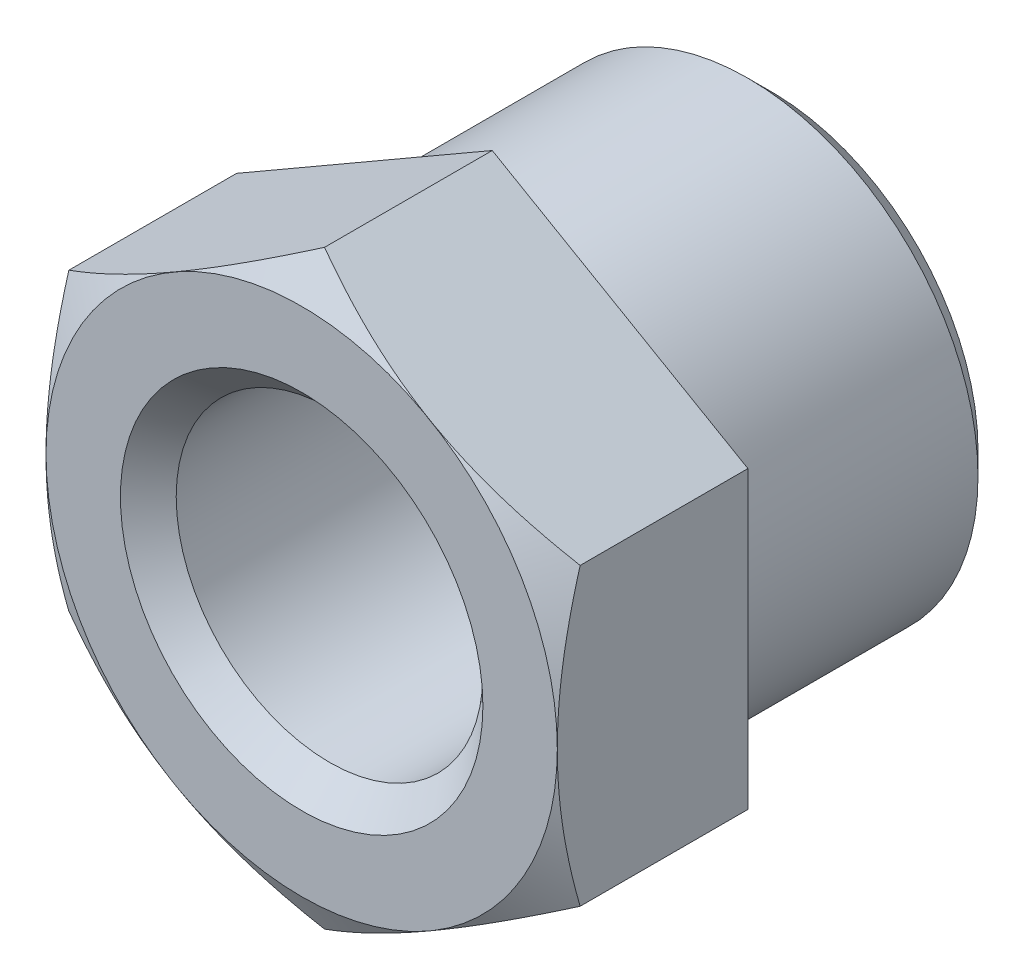
ISO-10303-21;
HEADER;
FILE_DESCRIPTION(('STEP AP214'),'2;1');
FILE_NAME('part.step','',(''),(''),'','','');
FILE_SCHEMA(('AUTOMOTIVE_DESIGN { 1 0 10303 214 1 1 1 1 }'));
ENDSEC;
DATA;
#1=APPLICATION_CONTEXT('core data for automotive mechanical design processes');
#2=APPLICATION_PROTOCOL_DEFINITION('international standard','automotive_design',2000,#1);
#3=PRODUCT_CONTEXT('',#1,'mechanical');
#4=PRODUCT('Part','Part','',(#3));
#5=PRODUCT_RELATED_PRODUCT_CATEGORY('part','',(#4));
#6=PRODUCT_DEFINITION_FORMATION('','',#4);
#7=PRODUCT_DEFINITION_CONTEXT('part definition',#1,'design');
#8=PRODUCT_DEFINITION('design','',#6,#7);
#9=PRODUCT_DEFINITION_SHAPE('','',#8);
#10=(LENGTH_UNIT() NAMED_UNIT(*) SI_UNIT(.MILLI.,.METRE.));
#11=(NAMED_UNIT(*) PLANE_ANGLE_UNIT() SI_UNIT($,.RADIAN.));
#12=(NAMED_UNIT(*) SI_UNIT($,.STERADIAN.) SOLID_ANGLE_UNIT());
#13=UNCERTAINTY_MEASURE_WITH_UNIT(LENGTH_MEASURE(1.E-05),#10,'distance_accuracy_value','');
#14=(GEOMETRIC_REPRESENTATION_CONTEXT(3) GLOBAL_UNCERTAINTY_ASSIGNED_CONTEXT((#13)) GLOBAL_UNIT_ASSIGNED_CONTEXT((#10,
#11,#12)) REPRESENTATION_CONTEXT('',''));
#15=CARTESIAN_POINT('',(0.,0.,0.));
#16=DIRECTION('',(0.,0.,1.));
#17=DIRECTION('',(1.,0.,0.));
#18=AXIS2_PLACEMENT_3D('',#15,#16,#17);
#19=CARTESIAN_POINT('',(0.,0.,-4.5085));
#20=DIRECTION('',(0.,0.,-1.));
#21=DIRECTION('',(-1.,0.,0.));
#22=AXIS2_PLACEMENT_3D('',#19,#20,#21);
#23=CYLINDRICAL_SURFACE('',#22,6.2865);
#24=CARTESIAN_POINT('',(0.,0.,-12.192));
#25=DIRECTION('',(0.,0.,-1.));
#26=DIRECTION('',(0.,1.,0.));
#27=AXIS2_PLACEMENT_3D('',#24,#25,#26);
#28=CIRCLE('',#27,6.2865);
#29=CARTESIAN_POINT('',(0.,6.2865,-12.192));
#30=VERTEX_POINT('',#29);
#31=EDGE_CURVE('E246',#30,#30,#28,.T.);
#32=ORIENTED_EDGE('',*,*,#31,.F.);
#33=EDGE_LOOP('',(#32));
#34=FACE_BOUND('',#33,.T.);
#35=CARTESIAN_POINT('',(0.,0.,-5.207));
#36=DIRECTION('',(0.,0.,-1.));
#37=DIRECTION('',(-1.,0.,0.));
#38=AXIS2_PLACEMENT_3D('',#35,#36,#37);
#39=CIRCLE('',#38,6.2865);
#40=CARTESIAN_POINT('',(-6.2865,0.,-5.207));
#41=VERTEX_POINT('',#40);
#42=EDGE_CURVE('E20',#41,#41,#39,.F.);
#43=ORIENTED_EDGE('',*,*,#42,.F.);
#44=EDGE_LOOP('',(#43));
#45=FACE_BOUND('',#44,.T.);
#46=ADVANCED_FACE('F16',(#34,#45),#23,.T.);
#47=CARTESIAN_POINT('',(6.985,-8.16128699912692,-5.207));
#48=DIRECTION('',(0.,0.,-1.));
#49=DIRECTION('',(-1.,0.,0.));
#50=AXIS2_PLACEMENT_3D('',#47,#48,#49);
#51=PLANE('',#50);
#52=ORIENTED_EDGE('',*,*,#42,.T.);
#53=EDGE_LOOP('',(#52));
#54=FACE_BOUND('',#53,.T.);
#55=DIRECTION('',(0.866025403784435,-0.500000000000007,0.));
#56=VECTOR('',#55,1.);
#57=CARTESIAN_POINT('',(-3.4925,-6.0481041848552,-5.207));
#58=LINE('',#57,#56);
#59=CARTESIAN_POINT('',(-6.98499999999993,-4.03170836971077,-5.207));
#60=VERTEX_POINT('',#59);
#61=CARTESIAN_POINT('',(0.,-8.0645,-5.207));
#62=VERTEX_POINT('',#61);
#63=EDGE_CURVE('E279',#60,#62,#58,.T.);
#64=ORIENTED_EDGE('',*,*,#63,.F.);
#65=DIRECTION('',(0.,-1.,0.));
#66=VECTOR('',#65,1.);
#67=CARTESIAN_POINT('',(-6.985,0.00108326057883914,-5.207));
#68=LINE('',#67,#66);
#69=CARTESIAN_POINT('',(-6.985,4.03387489086858,-5.207));
#70=VERTEX_POINT('',#69);
#71=EDGE_CURVE('E87',#70,#60,#68,.T.);
#72=ORIENTED_EDGE('',*,*,#71,.F.);
#73=DIRECTION('',(-0.866025403784435,-0.500000000000007,0.));
#74=VECTOR('',#73,1.);
#75=CARTESIAN_POINT('',(-3.4925,6.05027070601338,-5.207));
#76=LINE('',#75,#74);
#77=CARTESIAN_POINT('',(0.,8.06666652115819,-5.207));
#78=VERTEX_POINT('',#77);
#79=EDGE_CURVE('E271',#78,#70,#76,.T.);
#80=ORIENTED_EDGE('',*,*,#79,.F.);
#81=DIRECTION('',(-0.866025403784435,0.500000000000007,0.));
#82=VECTOR('',#81,1.);
#83=CARTESIAN_POINT('',(3.4925,6.05027070601338,-5.207));
#84=LINE('',#83,#82);
#85=CARTESIAN_POINT('',(6.985,4.03387489086858,-5.207));
#86=VERTEX_POINT('',#85);
#87=EDGE_CURVE('E261',#86,#78,#84,.T.);
#88=ORIENTED_EDGE('',*,*,#87,.F.);
#89=DIRECTION('',(0.,1.,0.));
#90=VECTOR('',#89,1.);
#91=CARTESIAN_POINT('',(6.985,0.00108326057883914,-5.207));
#92=LINE('',#91,#90);
#93=CARTESIAN_POINT('',(6.985,-4.03170836971073,-5.207));
#94=VERTEX_POINT('',#93);
#95=EDGE_CURVE('E254',#94,#86,#92,.T.);
#96=ORIENTED_EDGE('',*,*,#95,.F.);
#97=DIRECTION('',(0.866025403784435,0.500000000000007,0.));
#98=VECTOR('',#97,1.);
#99=CARTESIAN_POINT('',(3.4925,-6.0481041848552,-5.207));
#100=LINE('',#99,#98);
#101=EDGE_CURVE('E249',#62,#94,#100,.T.);
#102=ORIENTED_EDGE('',*,*,#101,.F.);
#103=EDGE_LOOP('',(#64,#72,#80,#88,#96,#102));
#104=FACE_BOUND('',#103,.T.);
#105=ADVANCED_FACE('F234',(#54,#104),#51,.T.);
#106=CARTESIAN_POINT('',(0.,0.,-12.1285));
#107=DIRECTION('',(0.,0.,1.));
#108=DIRECTION('',(1.,0.,0.));
#109=AXIS2_PLACEMENT_3D('',#106,#107,#108);
#110=CONICAL_SURFACE('',#109,6.35,0.785398163397448);
#111=ORIENTED_EDGE('',*,*,#31,.T.);
#112=EDGE_LOOP('',(#111));
#113=FACE_BOUND('',#112,.T.);
#114=CARTESIAN_POINT('',(0.,0.,-12.827));
#115=DIRECTION('',(0.,0.,1.));
#116=DIRECTION('',(1.,0.,0.));
#117=AXIS2_PLACEMENT_3D('',#114,#115,#116);
#118=CIRCLE('',#117,5.6515);
#119=CARTESIAN_POINT('',(5.6515,0.,-12.827));
#120=VERTEX_POINT('',#119);
#121=EDGE_CURVE('E88',#120,#120,#118,.F.);
#122=ORIENTED_EDGE('',*,*,#121,.F.);
#123=EDGE_LOOP('',(#122));
#124=FACE_BOUND('',#123,.T.);
#125=ADVANCED_FACE('F230',(#113,#124),#110,.T.);
#126=CARTESIAN_POINT('',(0.,-8.0645,-5.207));
#127=DIRECTION('',(0.500000000000007,-0.866025403784435,0.));
#128=DIRECTION('',(0.866025403784435,0.500000000000007,0.));
#129=AXIS2_PLACEMENT_3D('',#126,#127,#128);
#130=PLANE('',#129);
#131=ORIENTED_EDGE('',*,*,#101,.T.);
#132=DIRECTION('',(0.,0.,-1.));
#133=VECTOR('',#132,1.);
#134=CARTESIAN_POINT('',(6.985,-4.0317083697109,-2.587879));
#135=LINE('',#134,#133);
#136=CARTESIAN_POINT('',(6.985,-4.03170836971076,-0.623562357485163));
#137=VERTEX_POINT('',#136);
#138=EDGE_CURVE('E258',#137,#94,#135,.T.);
#139=ORIENTED_EDGE('',*,*,#138,.F.);
#140=CARTESIAN_POINT('',(3.5911702776349,-5.99113687350167,0.));
#141=CARTESIAN_POINT('',(3.73524611892084,-5.90795464775151,-0.00154926655879243));
#142=CARTESIAN_POINT('',(3.87928610456096,-5.82479312326811,-0.00657798005663551));
#143=CARTESIAN_POINT('',(4.16704483844373,-5.65865554079923,-0.023373223963552));
#144=CARTESIAN_POINT('',(4.31076364268868,-5.57567945048079,-0.0351384697799564));
#145=CARTESIAN_POINT('',(4.59701768470571,-5.41041060226564,-0.065116513372869));
#146=CARTESIAN_POINT('',(4.73955531763537,-5.32811646152405,-0.0832990386963194));
#147=CARTESIAN_POINT('',(5.02394745132829,-5.16392258658102,-0.125755048388477));
#148=CARTESIAN_POINT('',(5.16580193317152,-5.08202286330308,-0.150028700474948));
#149=CARTESIAN_POINT('',(5.58979915751715,-4.83722795169147,-0.23128512134236));
#150=CARTESIAN_POINT('',(5.87072458759034,-4.6750355790165,-0.296741834112847));
#151=CARTESIAN_POINT('',(6.43015699693444,-4.35204712688828,-0.446759338703408));
#152=CARTESIAN_POINT('',(6.70864624647853,-4.19126128369758,-0.531409047798544));
#153=CARTESIAN_POINT('',(6.98499999999982,-4.0317083697105,-0.623562357484995));
#154=B_SPLINE_CURVE_WITH_KNOTS('',3,(#140,#141,#142,#143,#144,#145,#146,#147,#148,#149,#150,
#151,#152,#153),.UNSPECIFIED.,.F.,.F.,(4,2,2,2,2,2,4),(0.,0.499065682751525,0.998036230101141,
1.4946837531994,1.99134495287294,2.98345617123692,3.98026111891649),.UNSPECIFIED.);
#155=CARTESIAN_POINT('',(3.59117027763756,-5.99113687350013,0.));
#156=VERTEX_POINT('',#155);
#157=EDGE_CURVE('E212',#156,#137,#154,.T.);
#158=ORIENTED_EDGE('',*,*,#157,.F.);
#159=DIRECTION('',(-0.866025403784435,-0.500000000000007,0.));
#160=VECTOR('',#159,1.);
#161=CARTESIAN_POINT('',(3.4925,-6.0481041848552,0.));
#162=LINE('',#161,#160);
#163=CARTESIAN_POINT('',(3.39289159118063,-6.10561312650061,0.));
#164=VERTEX_POINT('',#163);
#165=EDGE_CURVE('E201',#156,#164,#162,.T.);
#166=ORIENTED_EDGE('',*,*,#165,.T.);
#167=CARTESIAN_POINT('',(0.,-8.06449999999999,-0.623249615590151));
#168=CARTESIAN_POINT('',(0.276279709124286,-7.90498983556546,-0.531139462571051));
#169=CARTESIAN_POINT('',(0.554693783296573,-7.74424739489591,-0.446530866645139));
#170=CARTESIAN_POINT('',(1.1139744028162,-7.4213465786637,-0.296587816752658));
#171=CARTESIAN_POINT('',(1.39482323636993,-7.25919842900986,-0.231164515753889));
#172=CARTESIAN_POINT('',(1.81870361478494,-7.01447097842776,-0.149950296684653));
#173=CARTESIAN_POINT('',(1.96051872681603,-6.93259398532145,-0.125689405773082));
#174=CARTESIAN_POINT('',(2.24483160560906,-6.76844586821621,-0.0832558093614813));
#175=CARTESIAN_POINT('',(2.38732935349305,-6.68617475511647,-0.0650829364749879));
#176=CARTESIAN_POINT('',(2.67350277095776,-6.5209524555083,-0.0351207785775389));
#177=CARTESIAN_POINT('',(2.81718083285621,-6.43799988779458,-0.02336173778801));
#178=CARTESIAN_POINT('',(3.10485781314235,-6.27190950578672,-0.00657513019369618));
#179=CARTESIAN_POINT('',(3.24885678742779,-6.18877165921999,-0.00154884587546233));
#180=CARTESIAN_POINT('',(3.39289159118466,-6.10561312649829,0.));
#181=B_SPLINE_CURVE_WITH_KNOTS('',3,(#167,#168,#169,#170,#171,#172,#173,#174,#175,#176,#177,
#178,#179,#180),.UNSPECIFIED.,.F.,.F.,(4,2,2,2,2,2,4),(0.,0.996522204255266,1.98835387442409,
2.48487463280455,2.98138173851904,3.48021030047029,3.97913386808434),.UNSPECIFIED.);
#182=CARTESIAN_POINT('',(0.,-8.0645,-0.623249615590154));
#183=VERTEX_POINT('',#182);
#184=EDGE_CURVE('E209',#183,#164,#181,.T.);
#185=ORIENTED_EDGE('',*,*,#184,.F.);
#186=DIRECTION('',(0.,0.,1.));
#187=VECTOR('',#186,1.);
#188=CARTESIAN_POINT('',(0.,-8.0645,-2.6035));
#189=LINE('',#188,#187);
#190=EDGE_CURVE('E280',#62,#183,#189,.T.);
#191=ORIENTED_EDGE('',*,*,#190,.F.);
#192=EDGE_LOOP('',(#131,#139,#158,#166,#185,#191));
#193=FACE_BOUND('',#192,.T.);
#194=ADVANCED_FACE('F226',(#193),#130,.T.);
#195=CARTESIAN_POINT('',(6.985,-4.0317083697109,0.031242));
#196=DIRECTION('',(1.,0.,0.));
#197=DIRECTION('',(0.,0.,-1.));
#198=AXIS2_PLACEMENT_3D('',#195,#196,#197);
#199=PLANE('',#198);
#200=DIRECTION('',(0.,0.,-1.));
#201=VECTOR('',#200,1.);
#202=CARTESIAN_POINT('',(6.985,4.03387489086858,-2.57249638715442));
#203=LINE('',#202,#201);
#204=CARTESIAN_POINT('',(6.98499999999997,4.03387489086859,-0.624187778267878));
#205=VERTEX_POINT('',#204);
#206=EDGE_CURVE('E257',#205,#86,#203,.T.);
#207=ORIENTED_EDGE('',*,*,#206,.F.);
#208=CARTESIAN_POINT('',(6.985,0.,0.));
#209=CARTESIAN_POINT('',(6.985,0.171216799025103,2.85784971224168E-05));
#210=CARTESIAN_POINT('',(6.985,0.342425341244606,-0.00363391941370807));
#211=CARTESIAN_POINT('',(6.985,0.684506054381268,-0.0181286560913852));
#212=CARTESIAN_POINT('',(6.985,0.85537828523169,-0.0289594739362237));
#213=CARTESIAN_POINT('',(6.985,1.19568224572991,-0.0575070916985842));
#214=CARTESIAN_POINT('',(6.985,1.36511690691635,-0.0751892128414033));
#215=CARTESIAN_POINT('',(6.985,1.70317859546818,-0.117058906333671));
#216=CARTESIAN_POINT('',(6.985,1.87180560142291,-0.141246650183952));
#217=CARTESIAN_POINT('',(6.985,2.37577573208079,-0.222820698855327));
#218=CARTESIAN_POINT('',(6.985,2.70965414642544,-0.289257464891835));
#219=CARTESIAN_POINT('',(6.985,3.37453888881852,-0.442475139769411));
#220=CARTESIAN_POINT('',(6.985,3.70552200830192,-0.529357689165369));
#221=CARTESIAN_POINT('',(6.985,4.03387489086849,-0.624187778267862));
#222=B_SPLINE_CURVE_WITH_KNOTS('',3,(#208,#209,#210,#211,#212,#213,#214,#215,#216,#217,#218,
#219,#220,#221),.UNSPECIFIED.,.F.,.F.,(4,2,2,2,2,2,4),(0.,0.513597942212227,1.027094108256,
1.53802440174657,2.048968165671,3.06951543944967,4.09524744636837),.UNSPECIFIED.);
#223=CARTESIAN_POINT('',(6.985,0.,0.));
#224=VERTEX_POINT('',#223);
#225=EDGE_CURVE('E127',#224,#205,#222,.T.);
#226=ORIENTED_EDGE('',*,*,#225,.F.);
#227=CARTESIAN_POINT('',(6.985,-4.03170836971062,-0.623562357485123));
#228=CARTESIAN_POINT('',(6.985,-3.70352621261684,-0.528819552825142));
#229=CARTESIAN_POINT('',(6.985,-3.37271652391855,-0.442020232887802));
#230=CARTESIAN_POINT('',(6.985,-2.70818201153368,-0.288953056397303));
#231=CARTESIAN_POINT('',(6.985,-2.3744803506375,-0.222583714208962));
#232=CARTESIAN_POINT('',(6.985,-1.87078003172535,-0.141094408330606));
#233=CARTESIAN_POINT('',(6.985,-1.70224398415817,-0.116932207202834));
#234=CARTESIAN_POINT('',(6.985,-1.36436542842516,-0.075107137801858));
#235=CARTESIAN_POINT('',(6.985,-1.19502294157075,-0.0574440987331068));
#236=CARTESIAN_POINT('',(6.985,-0.854905373873239,-0.0289275371956884));
#237=CARTESIAN_POINT('',(6.985,-0.684127368412502,-0.0181086306974229));
#238=CARTESIAN_POINT('',(6.985,-0.342235693379948,-0.00362989575317371));
#239=CARTESIAN_POINT('',(6.985,-0.171121964102678,2.85163974846038E-05));
#240=CARTESIAN_POINT('',(6.985,0.,0.));
#241=B_SPLINE_CURVE_WITH_KNOTS('',3,(#227,#228,#229,#230,#231,#232,#233,#234,#235,#236,#237,
#238,#239,#240),.UNSPECIFIED.,.F.,.F.,(4,2,2,2,2,2,4),(0.,1.02516642094073,2.04515495109238,
2.55581789444359,3.06646741680499,3.57967945558141,4.09299299382873),.UNSPECIFIED.);
#242=EDGE_CURVE('E128',#137,#224,#241,.T.);
#243=ORIENTED_EDGE('',*,*,#242,.F.);
#244=ORIENTED_EDGE('',*,*,#138,.T.);
#245=ORIENTED_EDGE('',*,*,#95,.T.);
#246=EDGE_LOOP('',(#207,#226,#243,#244,#245));
#247=FACE_BOUND('',#246,.T.);
#248=ADVANCED_FACE('F161',(#247),#199,.T.);
#249=CARTESIAN_POINT('',(6.985,4.03387489086858,-5.207));
#250=DIRECTION('',(0.500000000000007,0.866025403784435,0.));
#251=DIRECTION('',(-0.866025403784435,0.500000000000007,0.));
#252=AXIS2_PLACEMENT_3D('',#249,#250,#251);
#253=PLANE('',#252);
#254=ORIENTED_EDGE('',*,*,#87,.T.);
#255=DIRECTION('',(0.,0.,-1.));
#256=VECTOR('',#255,1.);
#257=CARTESIAN_POINT('',(0.,8.06666652115819,-2.57253603617634));
#258=LINE('',#257,#256);
#259=CARTESIAN_POINT('',(0.,8.06666652115817,-0.624500457164219));
#260=VERTEX_POINT('',#259);
#261=EDGE_CURVE('E264',#260,#78,#258,.T.);
#262=ORIENTED_EDGE('',*,*,#261,.F.);
#263=CARTESIAN_POINT('',(6.98499999999995,4.03387489086861,-0.624187778267868));
#264=CARTESIAN_POINT('',(6.83145061894084,4.12252666735699,-0.573024831894619));
#265=CARTESIAN_POINT('',(6.67732874230447,4.21150897432101,-0.524184944595393));
#266=CARTESIAN_POINT('',(6.36783347398182,4.39019615080001,-0.431790939860297));
#267=CARTESIAN_POINT('',(6.21245957301253,4.47990131434967,-0.388239102568012));
#268=CARTESIAN_POINT('',(5.74385107187125,4.75045255862814,-0.266370967046166));
#269=CARTESIAN_POINT('',(5.42876704444691,4.93236640667894,-0.197060075984882));
#270=CARTESIAN_POINT('',(4.9572500741108,5.20459685642997,-0.11579625423685));
#271=CARTESIAN_POINT('',(4.80222521532391,5.29410050038167,-0.0926488101360374));
#272=CARTESIAN_POINT('',(4.49147557150756,5.47351189088962,-0.0538393471913701));
#273=CARTESIAN_POINT('',(4.33575084953389,5.5634196010406,-0.0381766671165264));
#274=CARTESIAN_POINT('',(4.02403146122899,5.74339087379006,-0.0147358958410847));
#275=CARTESIAN_POINT('',(3.86803730300108,5.83345414303496,-0.0069488618658238));
#276=CARTESIAN_POINT('',(3.55591412216677,6.01365854550997,0.00058205196624369));
#277=CARTESIAN_POINT('',(3.39978510387882,6.10379967624683,0.000326180471794861));
#278=CARTESIAN_POINT('',(2.97211219426787,6.35071674573583,-0.0114278088644742));
#279=CARTESIAN_POINT('',(2.70070883131555,6.50741155039533,-0.0311098879408439));
#280=CARTESIAN_POINT('',(2.15970527796026,6.81976009755755,-0.0934865193783676));
#281=CARTESIAN_POINT('',(1.89010698846679,6.97541274256967,-0.136202348965278));
#282=CARTESIAN_POINT('',(1.34801725222821,7.28838839771196,-0.242964714889579));
#283=CARTESIAN_POINT('',(1.0755941579365,7.44567194453475,-0.307463123012694));
#284=CARTESIAN_POINT('',(0.534808976534873,7.75789441459075,-0.45384110388285));
#285=CARTESIAN_POINT('',(0.266439971661192,7.91283733179672,-0.535686333897529));
#286=CARTESIAN_POINT('',(0.,8.06666652115815,-0.624500457164206));
#287=B_SPLINE_CURVE_WITH_KNOTS('',3,(#263,#264,#265,#266,#267,#268,#269,#270,#271,#272,#273,
#274,#275,#276,#277,#278,#279,#280,#281,#282,#283,#284,#285,#286),.UNSPECIFIED.,.F.,.F.,(4,2,2,
2,2,2,2,2,2,2,2,4),(0.,0.553569159864148,1.10737617077189,2.21728925885847,2.75865590141196,
3.29997470884242,3.84067815780213,4.38136489077506,5.32239941311737,6.26430470073683,
7.22709034350693,8.18798740462965),.UNSPECIFIED.);
#288=EDGE_CURVE('E151',#205,#260,#287,.T.);
#289=ORIENTED_EDGE('',*,*,#288,.F.);
#290=ORIENTED_EDGE('',*,*,#206,.T.);
#291=EDGE_LOOP('',(#254,#262,#289,#290));
#292=FACE_BOUND('',#291,.T.);
#293=ADVANCED_FACE('F157',(#292),#253,.T.);
#294=CARTESIAN_POINT('',(0.,8.06666652115819,-5.207));
#295=DIRECTION('',(-0.500000000000007,0.866025403784435,0.));
#296=DIRECTION('',(-0.866025403784435,-0.500000000000007,0.));
#297=AXIS2_PLACEMENT_3D('',#294,#295,#296);
#298=PLANE('',#297);
#299=ORIENTED_EDGE('',*,*,#79,.T.);
#300=DIRECTION('',(0.,0.,-1.));
#301=VECTOR('',#300,1.);
#302=CARTESIAN_POINT('',(-6.985,4.03387489086858,-2.587879));
#303=LINE('',#302,#301);
#304=CARTESIAN_POINT('',(-6.985,4.03387489086856,-0.624187778267917));
#305=VERTEX_POINT('',#304);
#306=EDGE_CURVE('E276',#305,#70,#303,.T.);
#307=ORIENTED_EDGE('',*,*,#306,.F.);
#308=CARTESIAN_POINT('',(0.,8.06666652115815,-0.624500457164207));
#309=CARTESIAN_POINT('',(-0.153556974970275,7.97801036032315,-0.573324673602653));
#310=CARTESIAN_POINT('',(-0.307686482091418,7.88902364789669,-0.524471627093957));
#311=CARTESIAN_POINT('',(-0.617197170484222,7.71032756863604,-0.432050706567077));
#312=CARTESIAN_POINT('',(-0.77257886111464,7.62061790772343,-0.388485112480133));
#313=CARTESIAN_POINT('',(-1.24121157249057,7.35005268565946,-0.266574722098356));
#314=CARTESIAN_POINT('',(-1.55631238398707,7.16812914732009,-0.19723455518571));
#315=CARTESIAN_POINT('',(-2.0278553083681,6.89588371299423,-0.115926882731131));
#316=CARTESIAN_POINT('',(-2.18288864132861,6.80637517647612,-0.0927650310713618));
#317=CARTESIAN_POINT('',(-2.49365572495335,6.6269537170901,-0.0539269182027629));
#318=CARTESIAN_POINT('',(-2.64938941250509,6.5370408306602,-0.0382499956127934));
#319=CARTESIAN_POINT('',(-2.96112719326421,6.35705893902235,-0.0147812677955594));
#320=CARTESIAN_POINT('',(-3.11713077757173,6.26699022762785,-0.00698051593674086));
#321=CARTESIAN_POINT('',(-3.42927332860075,6.0867746417657,0.000576966728402792));
#322=CARTESIAN_POINT('',(-3.58541229098273,5.99662776980348,0.000333946489839836));
#323=CARTESIAN_POINT('',(-4.01307580296071,5.74971612604041,-0.0113854441475121));
#324=CARTESIAN_POINT('',(-4.28446035531908,5.59303218168239,-0.0310436365072193));
#325=CARTESIAN_POINT('',(-4.8254278036614,5.28070447975912,-0.0933712873149261));
#326=CARTESIAN_POINT('',(-5.0950088005446,5.1250618186402,-0.136062018006042));
#327=CARTESIAN_POINT('',(-5.63706430097692,4.81210592954987,-0.242773953233884));
#328=CARTESIAN_POINT('',(-5.90947048371991,4.65483214661429,-0.307247003674364));
#329=CARTESIAN_POINT('',(-6.45022280632742,4.34262864759192,-0.453575550650988));
#330=CARTESIAN_POINT('',(-6.71857586002773,4.18769493980019,-0.535396714427131));
#331=CARTESIAN_POINT('',(-6.98499999999993,4.03387489086862,-0.624187778267899));
#332=B_SPLINE_CURVE_WITH_KNOTS('',3,(#308,#309,#310,#311,#312,#313,#314,#315,#316,#317,#318,
#319,#320,#321,#322,#323,#324,#325,#326,#327,#328,#329,#330,#331),.UNSPECIFIED.,.F.,.F.,(4,2,2,
2,2,2,2,2,2,2,2,4),(0.,0.553605118983338,1.10744810881466,2.21743491613766,2.75883621719655,
3.30018967025244,3.84092749961958,4.38164859314197,5.32261372750972,6.26444940379041,
7.22716229050715,8.18798741458143),.UNSPECIFIED.);
#333=EDGE_CURVE('E79',#260,#305,#332,.T.);
#334=ORIENTED_EDGE('',*,*,#333,.F.);
#335=ORIENTED_EDGE('',*,*,#261,.T.);
#336=EDGE_LOOP('',(#299,#307,#334,#335));
#337=FACE_BOUND('',#336,.T.);
#338=ADVANCED_FACE('F160',(#337),#298,.T.);
#339=CARTESIAN_POINT('',(-6.985,-4.03170836971039,-5.207));
#340=DIRECTION('',(-0.500000000000007,-0.866025403784435,0.));
#341=DIRECTION('',(0.866025403784435,-0.500000000000007,0.));
#342=AXIS2_PLACEMENT_3D('',#339,#340,#341);
#343=PLANE('',#342);
#344=ORIENTED_EDGE('',*,*,#63,.T.);
#345=ORIENTED_EDGE('',*,*,#190,.T.);
#346=CARTESIAN_POINT('',(-3.39289159118449,-6.10561312649838,0.));
#347=CARTESIAN_POINT('',(-3.24885678742764,-6.18877165922008,-0.00154884587548949));
#348=CARTESIAN_POINT('',(-3.10485781314221,-6.2719095057868,-0.00657513019372467));
#349=CARTESIAN_POINT('',(-2.81718083285608,-6.43799988779466,-0.0233617377880404));
#350=CARTESIAN_POINT('',(-2.67350277095764,-6.52095245550837,-0.0351207785775698));
#351=CARTESIAN_POINT('',(-2.38732935349295,-6.68617475511653,-0.0650829364750174));
#352=CARTESIAN_POINT('',(-2.24483160560897,-6.76844586821626,-0.083255809361509));
#353=CARTESIAN_POINT('',(-1.96051872681596,-6.93259398532149,-0.125689405773106));
#354=CARTESIAN_POINT('',(-1.81870361478487,-7.01447097842779,-0.149950296684677));
#355=CARTESIAN_POINT('',(-1.39482323636989,-7.25919842900988,-0.231164515753907));
#356=CARTESIAN_POINT('',(-1.11397440281619,-7.42134657866371,-0.296587816752671));
#357=CARTESIAN_POINT('',(-0.55469378329659,-7.7442473948959,-0.446530866645138));
#358=CARTESIAN_POINT('',(-0.27627970912432,-7.90498983556544,-0.531139462571042));
#359=CARTESIAN_POINT('',(0.,-8.06449999999996,-0.623249615590134));
#360=B_SPLINE_CURVE_WITH_KNOTS('',3,(#346,#347,#348,#349,#350,#351,#352,#353,#354,#355,#356,
#357,#358,#359),.UNSPECIFIED.,.F.,.F.,(4,2,2,2,2,2,4),(0.,0.498923567614012,0.997752129565228,
1.49425923527969,1.99077999366012,2.98261166382888,3.97913386808408),.UNSPECIFIED.);
#361=CARTESIAN_POINT('',(-3.3928915911817,-6.1056131265,0.));
#362=VERTEX_POINT('',#361);
#363=EDGE_CURVE('E207',#362,#183,#360,.T.);
#364=ORIENTED_EDGE('',*,*,#363,.F.);
#365=DIRECTION('',(-0.866025403784435,0.500000000000007,0.));
#366=VECTOR('',#365,1.);
#367=CARTESIAN_POINT('',(-3.4925,-6.0481041848552,0.));
#368=LINE('',#367,#366);
#369=CARTESIAN_POINT('',(-3.59117027763647,-5.99113687350077,0.));
#370=VERTEX_POINT('',#369);
#371=EDGE_CURVE('E35',#362,#370,#368,.T.);
#372=ORIENTED_EDGE('',*,*,#371,.T.);
#373=CARTESIAN_POINT('',(-6.98499999999982,-4.0317083697105,-0.623562357484983));
#374=CARTESIAN_POINT('',(-6.70864624647854,-4.19126128369757,-0.531409047798535));
#375=CARTESIAN_POINT('',(-6.43015699693447,-4.35204712688826,-0.446759338703402));
#376=CARTESIAN_POINT('',(-5.87072458759041,-4.67503557901646,-0.296741834112847));
#377=CARTESIAN_POINT('',(-5.58979915751723,-4.83722795169142,-0.231285121342364));
#378=CARTESIAN_POINT('',(-5.16580193317162,-5.08202286330302,-0.150028700474957));
#379=CARTESIAN_POINT('',(-5.02394745132841,-5.16392258658096,-0.125755048388487));
#380=CARTESIAN_POINT('',(-4.7395553176355,-5.32811646152398,-0.0832990386963333));
#381=CARTESIAN_POINT('',(-4.59701768470585,-5.41041060226556,-0.0651165133728848));
#382=CARTESIAN_POINT('',(-4.31076364268884,-5.57567945048071,-0.0351384697799757));
#383=CARTESIAN_POINT('',(-4.16704483844389,-5.65865554079914,-0.023373223963573));
#384=CARTESIAN_POINT('',(-3.87928610456114,-5.82479312326801,-0.00657798005665984));
#385=CARTESIAN_POINT('',(-3.73524611892102,-5.9079546477514,-0.00154926655881849));
#386=CARTESIAN_POINT('',(-3.5911702776351,-5.99113687350156,0.));
#387=B_SPLINE_CURVE_WITH_KNOTS('',3,(#373,#374,#375,#376,#377,#378,#379,#380,#381,#382,#383,
#384,#385,#386),.UNSPECIFIED.,.F.,.F.,(4,2,2,2,2,2,4),(0.,0.996804947679505,1.98891616604344,
2.48557736571695,2.98222488881518,3.48119543616476,3.98026111891626),.UNSPECIFIED.);
#388=CARTESIAN_POINT('',(-6.98499999999991,-4.0317083697107,-0.623562357485087));
#389=VERTEX_POINT('',#388);
#390=EDGE_CURVE('E68',#389,#370,#387,.T.);
#391=ORIENTED_EDGE('',*,*,#390,.F.);
#392=DIRECTION('',(0.,0.,1.));
#393=VECTOR('',#392,1.);
#394=CARTESIAN_POINT('',(-6.985,-4.0317083697109,-2.587879));
#395=LINE('',#394,#393);
#396=EDGE_CURVE('E73',#60,#389,#395,.T.);
#397=ORIENTED_EDGE('',*,*,#396,.F.);
#398=EDGE_LOOP('',(#344,#345,#364,#372,#391,#397));
#399=FACE_BOUND('',#398,.T.);
#400=ADVANCED_FACE('F71',(#399),#343,.T.);
#401=CARTESIAN_POINT('',(-6.985,4.03387489086858,-5.207));
#402=DIRECTION('',(-1.,0.,0.));
#403=DIRECTION('',(0.,-1.,0.));
#404=AXIS2_PLACEMENT_3D('',#401,#402,#403);
#405=PLANE('',#404);
#406=ORIENTED_EDGE('',*,*,#396,.T.);
#407=CARTESIAN_POINT('',(-6.985,0.,1.02632618008586E-13));
#408=CARTESIAN_POINT('',(-6.985,-0.171121964102682,2.85163975739172E-05));
#409=CARTESIAN_POINT('',(-6.985,-0.342235693379953,-0.003629895753085));
#410=CARTESIAN_POINT('',(-6.985,-0.684127368412508,-0.0181086306973366));
#411=CARTESIAN_POINT('',(-6.985,-0.854905373873246,-0.0289275371956039));
#412=CARTESIAN_POINT('',(-6.985,-1.19502294157076,-0.0574440987330261));
#413=CARTESIAN_POINT('',(-6.985,-1.36436542842517,-0.0751071378017795));
#414=CARTESIAN_POINT('',(-6.985,-1.70224398415817,-0.116932207202761));
#415=CARTESIAN_POINT('',(-6.985,-1.87078003172536,-0.141094408330537));
#416=CARTESIAN_POINT('',(-6.985,-2.3744803506375,-0.222583714208903));
#417=CARTESIAN_POINT('',(-6.985,-2.70818201153369,-0.288953056397252));
#418=CARTESIAN_POINT('',(-6.985,-3.37271652391855,-0.442020232887771));
#419=CARTESIAN_POINT('',(-6.985,-3.70352621261685,-0.52881955282512));
#420=CARTESIAN_POINT('',(-6.985,-4.03170836971063,-0.623562357485112));
#421=B_SPLINE_CURVE_WITH_KNOTS('',3,(#407,#408,#409,#410,#411,#412,#413,#414,#415,#416,#417,
#418,#419,#420),.UNSPECIFIED.,.F.,.F.,(4,2,2,2,2,2,4),(0.,0.513313538247315,1.02652557702374,
1.53717509938515,2.04783804273635,3.06782657288801,4.09299299382874),.UNSPECIFIED.);
#422=CARTESIAN_POINT('',(-6.98500000000009,0.,0.));
#423=VERTEX_POINT('',#422);
#424=EDGE_CURVE('E78',#423,#389,#421,.T.);
#425=ORIENTED_EDGE('',*,*,#424,.F.);
#426=CARTESIAN_POINT('',(-6.985,4.03387489086854,-0.624187778267912));
#427=CARTESIAN_POINT('',(-6.985,3.70552200830196,-0.529357689165416));
#428=CARTESIAN_POINT('',(-6.985,3.37453888881856,-0.442475139769458));
#429=CARTESIAN_POINT('',(-6.985,2.70965414642547,-0.28925746489188));
#430=CARTESIAN_POINT('',(-6.985,2.37577573208082,-0.222820698855371));
#431=CARTESIAN_POINT('',(-6.985,1.87180560142293,-0.141246650183995));
#432=CARTESIAN_POINT('',(-6.985,1.7031785954682,-0.117058906333714));
#433=CARTESIAN_POINT('',(-6.985,1.36511690691637,-0.0751892128414456));
#434=CARTESIAN_POINT('',(-6.985,1.19568224572992,-0.0575070916986266));
#435=CARTESIAN_POINT('',(-6.985,0.855378285231696,-0.0289594739362663));
#436=CARTESIAN_POINT('',(-6.985,0.684506054381272,-0.0181286560914279));
#437=CARTESIAN_POINT('',(-6.985,0.342425341244606,-0.00363391941375067));
#438=CARTESIAN_POINT('',(-6.985,0.171216799025101,2.85784970800387E-05));
#439=CARTESIAN_POINT('',(-6.985,0.,0.));
#440=B_SPLINE_CURVE_WITH_KNOTS('',3,(#426,#427,#428,#429,#430,#431,#432,#433,#434,#435,#436,
#437,#438,#439),.UNSPECIFIED.,.F.,.F.,(4,2,2,2,2,2,4),(0.,1.02573200691872,2.0462792806974,
2.55722304462184,3.06815333811242,3.58164950415619,4.09524744636843),.UNSPECIFIED.);
#441=EDGE_CURVE('E121',#305,#423,#440,.T.);
#442=ORIENTED_EDGE('',*,*,#441,.F.);
#443=ORIENTED_EDGE('',*,*,#306,.T.);
#444=ORIENTED_EDGE('',*,*,#71,.T.);
#445=EDGE_LOOP('',(#406,#425,#442,#443,#444));
#446=FACE_BOUND('',#445,.T.);
#447=ADVANCED_FACE('F82',(#446),#405,.T.);
#448=CARTESIAN_POINT('',(5.719318,-5.719318,-12.827));
#449=DIRECTION('',(0.,0.,-1.));
#450=DIRECTION('',(-1.,0.,0.));
#451=AXIS2_PLACEMENT_3D('',#448,#449,#450);
#452=PLANE('',#451);
#453=CARTESIAN_POINT('',(0.,0.,-12.827));
#454=DIRECTION('',(0.,0.,-1.));
#455=DIRECTION('',(0.,1.,0.));
#456=AXIS2_PLACEMENT_3D('',#453,#454,#455);
#457=CIRCLE('',#456,4.95173000000002);
#458=CARTESIAN_POINT('',(0.,4.95173000000002,-12.827));
#459=VERTEX_POINT('',#458);
#460=EDGE_CURVE('E93',#459,#459,#457,.T.);
#461=ORIENTED_EDGE('',*,*,#460,.F.);
#462=EDGE_LOOP('',(#461));
#463=FACE_BOUND('',#462,.T.);
#464=ORIENTED_EDGE('',*,*,#121,.T.);
#465=EDGE_LOOP('',(#464));
#466=FACE_BOUND('',#465,.T.);
#467=ADVANCED_FACE('F115',(#463,#466),#452,.T.);
#468=CARTESIAN_POINT('',(0.,-4.9684644521156E-13,-0.689688024612048));
#469=DIRECTION('',(0.,0.,-1.));
#470=DIRECTION('',(-1.,0.,0.));
#471=AXIS2_PLACEMENT_3D('',#468,#469,#470);
#472=CONICAL_SURFACE('',#471,8.17957469999945,1.04719755119656);
#473=ORIENTED_EDGE('',*,*,#184,.T.);
#474=CARTESIAN_POINT('',(0.,-4.9684644521156E-13,0.));
#475=DIRECTION('',(0.,0.,1.));
#476=DIRECTION('',(1.,0.,0.));
#477=AXIS2_PLACEMENT_3D('',#474,#475,#476);
#478=CIRCLE('',#477,6.98499999999968);
#479=EDGE_CURVE('E96',#362,#164,#478,.T.);
#480=ORIENTED_EDGE('',*,*,#479,.F.);
#481=ORIENTED_EDGE('',*,*,#363,.T.);
#482=EDGE_LOOP('',(#473,#480,#481));
#483=FACE_BOUND('',#482,.T.);
#484=ADVANCED_FACE('F206',(#483),#472,.T.);
#485=CARTESIAN_POINT('',(-1.21288130025001E-13,0.,-0.69003410479314));
#486=DIRECTION('',(0.,0.,-1.));
#487=DIRECTION('',(-1.,0.,0.));
#488=AXIS2_PLACEMENT_3D('',#485,#486,#487);
#489=CONICAL_SURFACE('',#488,8.18017412845712,1.04719755119658);
#490=ORIENTED_EDGE('',*,*,#242,.T.);
#491=CARTESIAN_POINT('',(-1.21288130025001E-13,0.,0.));
#492=DIRECTION('',(0.,0.,1.));
#493=DIRECTION('',(1.,0.,0.));
#494=AXIS2_PLACEMENT_3D('',#491,#492,#493);
#495=CIRCLE('',#494,6.98500000000015);
#496=EDGE_CURVE('E196',#156,#224,#495,.T.);
#497=ORIENTED_EDGE('',*,*,#496,.F.);
#498=ORIENTED_EDGE('',*,*,#157,.T.);
#499=EDGE_LOOP('',(#490,#497,#498));
#500=FACE_BOUND('',#499,.T.);
#501=ADVANCED_FACE('F142',(#500),#489,.T.);
#502=CARTESIAN_POINT('',(0.,0.,-0.694725268194132));
#503=DIRECTION('',(0.,0.,-1.));
#504=DIRECTION('',(-1.,0.,0.));
#505=AXIS2_PLACEMENT_3D('',#502,#503,#504);
#506=CONICAL_SURFACE('',#505,8.18829946181388,1.04719755119652);
#507=ORIENTED_EDGE('',*,*,#288,.T.);
#508=ORIENTED_EDGE('',*,*,#333,.T.);
#509=ORIENTED_EDGE('',*,*,#441,.T.);
#510=CARTESIAN_POINT('',(0.,0.,0.));
#511=DIRECTION('',(0.,0.,-1.));
#512=DIRECTION('',(-1.,0.,0.));
#513=AXIS2_PLACEMENT_3D('',#510,#511,#512);
#514=CIRCLE('',#513,6.98500000000002);
#515=EDGE_CURVE('E191',#224,#423,#514,.F.);
#516=ORIENTED_EDGE('',*,*,#515,.F.);
#517=ORIENTED_EDGE('',*,*,#225,.T.);
#518=EDGE_LOOP('',(#507,#508,#509,#516,#517));
#519=FACE_BOUND('',#518,.T.);
#520=ADVANCED_FACE('F139',(#519),#506,.T.);
#521=CARTESIAN_POINT('',(-2.84272092153305E-13,0.,-0.69003410479314));
#522=DIRECTION('',(0.,0.,-1.));
#523=DIRECTION('',(-1.,0.,0.));
#524=AXIS2_PLACEMENT_3D('',#521,#522,#523);
#525=CONICAL_SURFACE('',#524,8.18017412845678,1.04719755119655);
#526=CARTESIAN_POINT('',(-2.84272092153305E-13,0.,0.));
#527=DIRECTION('',(0.,0.,1.));
#528=DIRECTION('',(1.,0.,0.));
#529=AXIS2_PLACEMENT_3D('',#526,#527,#528);
#530=CIRCLE('',#529,6.98499999999989);
#531=EDGE_CURVE('E91',#423,#370,#530,.T.);
#532=ORIENTED_EDGE('',*,*,#531,.F.);
#533=ORIENTED_EDGE('',*,*,#424,.T.);
#534=ORIENTED_EDGE('',*,*,#390,.T.);
#535=EDGE_LOOP('',(#532,#533,#534));
#536=FACE_BOUND('',#535,.T.);
#537=ADVANCED_FACE('F90',(#536),#525,.T.);
#538=CARTESIAN_POINT('',(0.,0.,-12.065));
#539=DIRECTION('',(0.,0.,-1.));
#540=DIRECTION('',(0.,1.,0.));
#541=AXIS2_PLACEMENT_3D('',#538,#539,#540);
#542=CONICAL_SURFACE('',#541,4.18973,0.785398163397449);
#543=ORIENTED_EDGE('',*,*,#460,.T.);
#544=EDGE_LOOP('',(#543));
#545=FACE_BOUND('',#544,.T.);
#546=CARTESIAN_POINT('',(0.,0.,-12.065));
#547=DIRECTION('',(0.,0.,-1.));
#548=DIRECTION('',(-1.,0.,0.));
#549=AXIS2_PLACEMENT_3D('',#546,#547,#548);
#550=CIRCLE('',#549,4.18973);
#551=CARTESIAN_POINT('',(-4.18973,0.,-12.065));
#552=VERTEX_POINT('',#551);
#553=EDGE_CURVE('E192',#552,#552,#550,.T.);
#554=ORIENTED_EDGE('',*,*,#553,.F.);
#555=EDGE_LOOP('',(#554));
#556=FACE_BOUND('',#555,.T.);
#557=ADVANCED_FACE('F187',(#545,#556),#542,.F.);
#558=CARTESIAN_POINT('',(-7.06882,-7.06882,0.));
#559=DIRECTION('',(0.,0.,1.));
#560=DIRECTION('',(1.,0.,0.));
#561=AXIS2_PLACEMENT_3D('',#558,#559,#560);
#562=PLANE('',#561);
#563=CARTESIAN_POINT('',(0.,0.,0.));
#564=DIRECTION('',(0.,0.,1.));
#565=DIRECTION('',(1.,0.,0.));
#566=AXIS2_PLACEMENT_3D('',#563,#564,#565);
#567=CIRCLE('',#566,4.95173000000002);
#568=CARTESIAN_POINT('',(4.95173000000002,0.,0.));
#569=VERTEX_POINT('',#568);
#570=EDGE_CURVE('E11',#569,#569,#567,.T.);
#571=ORIENTED_EDGE('',*,*,#570,.F.);
#572=EDGE_LOOP('',(#571));
#573=FACE_BOUND('',#572,.T.);
#574=ORIENTED_EDGE('',*,*,#531,.T.);
#575=ORIENTED_EDGE('',*,*,#371,.F.);
#576=ORIENTED_EDGE('',*,*,#479,.T.);
#577=ORIENTED_EDGE('',*,*,#165,.F.);
#578=ORIENTED_EDGE('',*,*,#496,.T.);
#579=ORIENTED_EDGE('',*,*,#515,.T.);
#580=EDGE_LOOP('',(#574,#575,#576,#577,#578,#579));
#581=FACE_BOUND('',#580,.T.);
#582=ADVANCED_FACE('F179',(#573,#581),#562,.T.);
#583=CARTESIAN_POINT('',(0.,0.,-0.762));
#584=DIRECTION('',(0.,0.,-1.));
#585=DIRECTION('',(-1.,0.,0.));
#586=AXIS2_PLACEMENT_3D('',#583,#584,#585);
#587=CYLINDRICAL_SURFACE('',#586,4.18973);
#588=ORIENTED_EDGE('',*,*,#553,.T.);
#589=EDGE_LOOP('',(#588));
#590=FACE_BOUND('',#589,.T.);
#591=CARTESIAN_POINT('',(0.,0.,-0.762));
#592=DIRECTION('',(0.,0.,-1.));
#593=DIRECTION('',(-1.,0.,0.));
#594=AXIS2_PLACEMENT_3D('',#591,#592,#593);
#595=CIRCLE('',#594,4.18973);
#596=CARTESIAN_POINT('',(-4.18973,0.,-0.762));
#597=VERTEX_POINT('',#596);
#598=EDGE_CURVE('E26',#597,#597,#595,.T.);
#599=ORIENTED_EDGE('',*,*,#598,.F.);
#600=EDGE_LOOP('',(#599));
#601=FACE_BOUND('',#600,.T.);
#602=ADVANCED_FACE('F174',(#590,#601),#587,.F.);
#603=CARTESIAN_POINT('',(0.,0.,-0.762));
#604=DIRECTION('',(0.,0.,1.));
#605=DIRECTION('',(1.,0.,0.));
#606=AXIS2_PLACEMENT_3D('',#603,#604,#605);
#607=CONICAL_SURFACE('',#606,4.18973,0.785398163397448);
#608=ORIENTED_EDGE('',*,*,#598,.T.);
#609=EDGE_LOOP('',(#608));
#610=FACE_BOUND('',#609,.T.);
#611=ORIENTED_EDGE('',*,*,#570,.T.);
#612=EDGE_LOOP('',(#611));
#613=FACE_BOUND('',#612,.T.);
#614=ADVANCED_FACE('F18',(#610,#613),#607,.F.);
#615=CLOSED_SHELL('',(#46,#105,#125,#194,#248,#293,#338,#400,#447,#467,#484,#501,#520,#537,#557,
#582,#602,#614));
#616=MANIFOLD_SOLID_BREP('B1',#615);
#617=ADVANCED_BREP_SHAPE_REPRESENTATION('',(#18,#616),#14);
#618=SHAPE_DEFINITION_REPRESENTATION(#9,#617);
ENDSEC;
END-ISO-10303-21;
